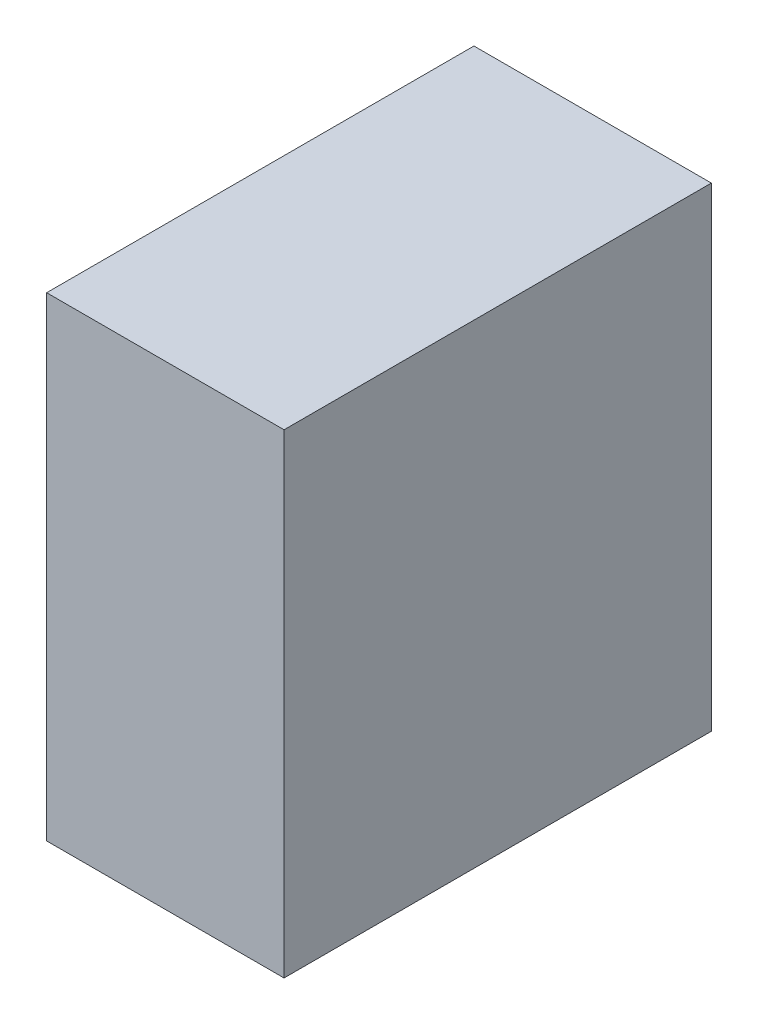
ISO-10303-21;
HEADER;
FILE_DESCRIPTION(('STEP AP214'),'2;1');
FILE_NAME('part.step','',(''),(''),'','','');
FILE_SCHEMA(('AUTOMOTIVE_DESIGN { 1 0 10303 214 1 1 1 1 }'));
ENDSEC;
DATA;
#1=APPLICATION_CONTEXT('core data for automotive mechanical design processes');
#2=APPLICATION_PROTOCOL_DEFINITION('international standard','automotive_design',2000,#1);
#3=PRODUCT_CONTEXT('',#1,'mechanical');
#4=PRODUCT('Part','Part','',(#3));
#5=PRODUCT_RELATED_PRODUCT_CATEGORY('part','',(#4));
#6=PRODUCT_DEFINITION_FORMATION('','',#4);
#7=PRODUCT_DEFINITION_CONTEXT('part definition',#1,'design');
#8=PRODUCT_DEFINITION('design','',#6,#7);
#9=PRODUCT_DEFINITION_SHAPE('','',#8);
#10=(LENGTH_UNIT() NAMED_UNIT(*) SI_UNIT(.MILLI.,.METRE.));
#11=(NAMED_UNIT(*) PLANE_ANGLE_UNIT() SI_UNIT($,.RADIAN.));
#12=(NAMED_UNIT(*) SI_UNIT($,.STERADIAN.) SOLID_ANGLE_UNIT());
#13=UNCERTAINTY_MEASURE_WITH_UNIT(LENGTH_MEASURE(1.E-05),#10,'distance_accuracy_value','');
#14=(GEOMETRIC_REPRESENTATION_CONTEXT(3) GLOBAL_UNCERTAINTY_ASSIGNED_CONTEXT((#13)) GLOBAL_UNIT_ASSIGNED_CONTEXT((#10,
#11,#12)) REPRESENTATION_CONTEXT('',''));
#15=CARTESIAN_POINT('',(0.,0.,0.));
#16=DIRECTION('',(0.,0.,1.));
#17=DIRECTION('',(1.,0.,0.));
#18=AXIS2_PLACEMENT_3D('',#15,#16,#17);
#19=CARTESIAN_POINT('',(3.175,-6.35,0.));
#20=DIRECTION('',(-1.,0.,0.));
#21=DIRECTION('',(0.,0.,1.));
#22=AXIS2_PLACEMENT_3D('',#19,#20,#21);
#23=PLANE('',#22);
#24=DIRECTION('',(0.,0.,-1.));
#25=VECTOR('',#24,1.);
#26=CARTESIAN_POINT('',(3.175,6.35,0.));
#27=LINE('',#26,#25);
#28=CARTESIAN_POINT('',(3.175,6.35,0.));
#29=VERTEX_POINT('',#28);
#30=CARTESIAN_POINT('',(3.175,6.35,11.43));
#31=VERTEX_POINT('',#30);
#32=EDGE_CURVE('E20',#29,#31,#27,.F.);
#33=ORIENTED_EDGE('',*,*,#32,.T.);
#34=DIRECTION('',(0.,1.,0.));
#35=VECTOR('',#34,1.);
#36=CARTESIAN_POINT('',(3.175,6.35,11.43));
#37=LINE('',#36,#35);
#38=CARTESIAN_POINT('',(3.175,-6.35,11.43));
#39=VERTEX_POINT('',#38);
#40=EDGE_CURVE('E55',#31,#39,#37,.F.);
#41=ORIENTED_EDGE('',*,*,#40,.T.);
#42=DIRECTION('',(0.,0.,1.));
#43=VECTOR('',#42,1.);
#44=CARTESIAN_POINT('',(3.175,-6.35,0.));
#45=LINE('',#44,#43);
#46=CARTESIAN_POINT('',(3.175,-6.35,0.));
#47=VERTEX_POINT('',#46);
#48=EDGE_CURVE('E74',#39,#47,#45,.F.);
#49=ORIENTED_EDGE('',*,*,#48,.T.);
#50=DIRECTION('',(0.,1.,0.));
#51=VECTOR('',#50,1.);
#52=CARTESIAN_POINT('',(3.175,6.35,0.));
#53=LINE('',#52,#51);
#54=EDGE_CURVE('E66',#29,#47,#53,.F.);
#55=ORIENTED_EDGE('',*,*,#54,.F.);
#56=EDGE_LOOP('',(#33,#41,#49,#55));
#57=FACE_BOUND('',#56,.T.);
#58=ADVANCED_FACE('F17',(#57),#23,.F.);
#59=CARTESIAN_POINT('',(3.175,6.35,0.));
#60=DIRECTION('',(0.,-1.,0.));
#61=DIRECTION('',(0.,0.,-1.));
#62=AXIS2_PLACEMENT_3D('',#59,#60,#61);
#63=PLANE('',#62);
#64=DIRECTION('',(0.,0.,-1.));
#65=VECTOR('',#64,1.);
#66=CARTESIAN_POINT('',(-3.175,6.35,0.));
#67=LINE('',#66,#65);
#68=CARTESIAN_POINT('',(-3.175,6.35,0.));
#69=VERTEX_POINT('',#68);
#70=CARTESIAN_POINT('',(-3.175,6.35,11.43));
#71=VERTEX_POINT('',#70);
#72=EDGE_CURVE('E72',#69,#71,#67,.F.);
#73=ORIENTED_EDGE('',*,*,#72,.T.);
#74=DIRECTION('',(-1.,0.,0.));
#75=VECTOR('',#74,1.);
#76=CARTESIAN_POINT('',(3.175,6.35,11.43));
#77=LINE('',#76,#75);
#78=EDGE_CURVE('E62',#71,#31,#77,.F.);
#79=ORIENTED_EDGE('',*,*,#78,.T.);
#80=ORIENTED_EDGE('',*,*,#32,.F.);
#81=DIRECTION('',(-1.,0.,0.));
#82=VECTOR('',#81,1.);
#83=CARTESIAN_POINT('',(3.175,6.35,0.));
#84=LINE('',#83,#82);
#85=EDGE_CURVE('E80',#69,#29,#84,.F.);
#86=ORIENTED_EDGE('',*,*,#85,.F.);
#87=EDGE_LOOP('',(#73,#79,#80,#86));
#88=FACE_BOUND('',#87,.T.);
#89=ADVANCED_FACE('F71',(#88),#63,.F.);
#90=CARTESIAN_POINT('',(3.175,6.35,11.43));
#91=DIRECTION('',(0.,0.,-1.));
#92=DIRECTION('',(-1.,0.,0.));
#93=AXIS2_PLACEMENT_3D('',#90,#91,#92);
#94=PLANE('',#93);
#95=DIRECTION('',(0.,1.,0.));
#96=VECTOR('',#95,1.);
#97=CARTESIAN_POINT('',(-3.175,6.35,11.43));
#98=LINE('',#97,#96);
#99=CARTESIAN_POINT('',(-3.175,-6.35,11.43));
#100=VERTEX_POINT('',#99);
#101=EDGE_CURVE('E83',#71,#100,#98,.F.);
#102=ORIENTED_EDGE('',*,*,#101,.T.);
#103=DIRECTION('',(1.,0.,0.));
#104=VECTOR('',#103,1.);
#105=CARTESIAN_POINT('',(-3.175,-6.35,11.43));
#106=LINE('',#105,#104);
#107=EDGE_CURVE('E64',#100,#39,#106,.T.);
#108=ORIENTED_EDGE('',*,*,#107,.T.);
#109=ORIENTED_EDGE('',*,*,#40,.F.);
#110=ORIENTED_EDGE('',*,*,#78,.F.);
#111=EDGE_LOOP('',(#102,#108,#109,#110));
#112=FACE_BOUND('',#111,.T.);
#113=ADVANCED_FACE('F60',(#112),#94,.F.);
#114=CARTESIAN_POINT('',(-3.175,-6.35,0.));
#115=DIRECTION('',(0.,1.,0.));
#116=DIRECTION('',(0.,0.,1.));
#117=AXIS2_PLACEMENT_3D('',#114,#115,#116);
#118=PLANE('',#117);
#119=ORIENTED_EDGE('',*,*,#48,.F.);
#120=ORIENTED_EDGE('',*,*,#107,.F.);
#121=DIRECTION('',(0.,0.,-1.));
#122=VECTOR('',#121,1.);
#123=CARTESIAN_POINT('',(-3.175,-6.35,0.));
#124=LINE('',#123,#122);
#125=CARTESIAN_POINT('',(-3.175,-6.35,0.));
#126=VERTEX_POINT('',#125);
#127=EDGE_CURVE('E26',#100,#126,#124,.T.);
#128=ORIENTED_EDGE('',*,*,#127,.T.);
#129=DIRECTION('',(-1.,0.,0.));
#130=VECTOR('',#129,1.);
#131=CARTESIAN_POINT('',(3.175,-6.35,0.));
#132=LINE('',#131,#130);
#133=EDGE_CURVE('E34',#47,#126,#132,.T.);
#134=ORIENTED_EDGE('',*,*,#133,.F.);
#135=EDGE_LOOP('',(#119,#120,#128,#134));
#136=FACE_BOUND('',#135,.T.);
#137=ADVANCED_FACE('F88',(#136),#118,.F.);
#138=CARTESIAN_POINT('',(3.175,6.35,0.));
#139=DIRECTION('',(0.,0.,-1.));
#140=DIRECTION('',(-1.,0.,0.));
#141=AXIS2_PLACEMENT_3D('',#138,#139,#140);
#142=PLANE('',#141);
#143=DIRECTION('',(0.,1.,0.));
#144=VECTOR('',#143,1.);
#145=CARTESIAN_POINT('',(-3.175,6.35,0.));
#146=LINE('',#145,#144);
#147=EDGE_CURVE('E11',#126,#69,#146,.T.);
#148=ORIENTED_EDGE('',*,*,#147,.T.);
#149=ORIENTED_EDGE('',*,*,#85,.T.);
#150=ORIENTED_EDGE('',*,*,#54,.T.);
#151=ORIENTED_EDGE('',*,*,#133,.T.);
#152=EDGE_LOOP('',(#148,#149,#150,#151));
#153=FACE_BOUND('',#152,.T.);
#154=ADVANCED_FACE('F91',(#153),#142,.T.);
#155=CARTESIAN_POINT('',(-3.175,6.35,0.));
#156=DIRECTION('',(1.,0.,0.));
#157=DIRECTION('',(0.,0.,-1.));
#158=AXIS2_PLACEMENT_3D('',#155,#156,#157);
#159=PLANE('',#158);
#160=ORIENTED_EDGE('',*,*,#127,.F.);
#161=ORIENTED_EDGE('',*,*,#101,.F.);
#162=ORIENTED_EDGE('',*,*,#72,.F.);
#163=ORIENTED_EDGE('',*,*,#147,.F.);
#164=EDGE_LOOP('',(#160,#161,#162,#163));
#165=FACE_BOUND('',#164,.T.);
#166=ADVANCED_FACE('F90',(#165),#159,.F.);
#167=CLOSED_SHELL('',(#58,#89,#113,#137,#154,#166));
#168=MANIFOLD_SOLID_BREP('B1',#167);
#169=ADVANCED_BREP_SHAPE_REPRESENTATION('',(#18,#168),#14);
#170=SHAPE_DEFINITION_REPRESENTATION(#9,#169);
ENDSEC;
END-ISO-10303-21;
